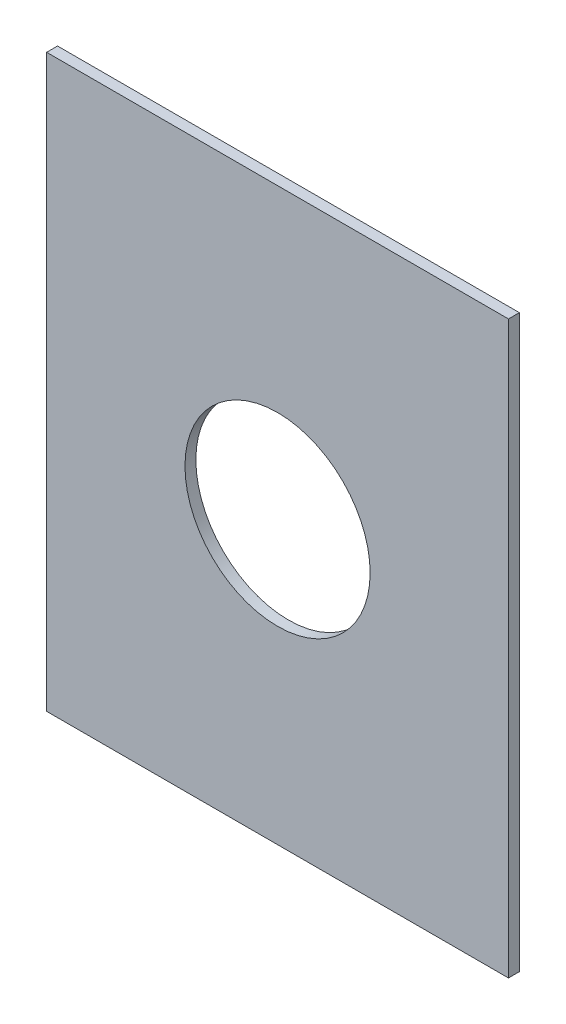
ISO-10303-21;
HEADER;
FILE_DESCRIPTION(('STEP AP214'),'2;1');
FILE_NAME('part.step','',(''),(''),'','','');
FILE_SCHEMA(('AUTOMOTIVE_DESIGN { 1 0 10303 214 1 1 1 1 }'));
ENDSEC;
DATA;
#1=APPLICATION_CONTEXT('core data for automotive mechanical design processes');
#2=APPLICATION_PROTOCOL_DEFINITION('international standard','automotive_design',2000,#1);
#3=PRODUCT_CONTEXT('',#1,'mechanical');
#4=PRODUCT('Part','Part','',(#3));
#5=PRODUCT_RELATED_PRODUCT_CATEGORY('part','',(#4));
#6=PRODUCT_DEFINITION_FORMATION('','',#4);
#7=PRODUCT_DEFINITION_CONTEXT('part definition',#1,'design');
#8=PRODUCT_DEFINITION('design','',#6,#7);
#9=PRODUCT_DEFINITION_SHAPE('','',#8);
#10=(LENGTH_UNIT() NAMED_UNIT(*) SI_UNIT(.MILLI.,.METRE.));
#11=(NAMED_UNIT(*) PLANE_ANGLE_UNIT() SI_UNIT($,.RADIAN.));
#12=(NAMED_UNIT(*) SI_UNIT($,.STERADIAN.) SOLID_ANGLE_UNIT());
#13=UNCERTAINTY_MEASURE_WITH_UNIT(LENGTH_MEASURE(1.E-05),#10,'distance_accuracy_value','');
#14=(GEOMETRIC_REPRESENTATION_CONTEXT(3) GLOBAL_UNCERTAINTY_ASSIGNED_CONTEXT((#13)) GLOBAL_UNIT_ASSIGNED_CONTEXT((#10,
#11,#12)) REPRESENTATION_CONTEXT('',''));
#15=CARTESIAN_POINT('',(0.,0.,0.));
#16=DIRECTION('',(0.,0.,1.));
#17=DIRECTION('',(1.,0.,0.));
#18=AXIS2_PLACEMENT_3D('',#15,#16,#17);
#19=CARTESIAN_POINT('',(0.,0.,5.));
#20=DIRECTION('',(1.,0.,0.));
#21=DIRECTION('',(0.,0.,-1.));
#22=AXIS2_PLACEMENT_3D('',#19,#20,#21);
#23=PLANE('',#22);
#24=DIRECTION('',(0.,-1.,0.));
#25=VECTOR('',#24,1.);
#26=CARTESIAN_POINT('',(0.,0.,0.));
#27=LINE('',#26,#25);
#28=CARTESIAN_POINT('',(0.,262.,0.));
#29=VERTEX_POINT('',#28);
#30=CARTESIAN_POINT('',(0.,0.,0.));
#31=VERTEX_POINT('',#30);
#32=EDGE_CURVE('E96',#29,#31,#27,.T.);
#33=ORIENTED_EDGE('',*,*,#32,.T.);
#34=DIRECTION('',(0.,0.,-1.));
#35=VECTOR('',#34,1.);
#36=CARTESIAN_POINT('',(0.,0.,5.));
#37=LINE('',#36,#35);
#38=CARTESIAN_POINT('',(0.,0.,5.));
#39=VERTEX_POINT('',#38);
#40=EDGE_CURVE('E11',#39,#31,#37,.T.);
#41=ORIENTED_EDGE('',*,*,#40,.F.);
#42=DIRECTION('',(0.,-1.,0.));
#43=VECTOR('',#42,1.);
#44=CARTESIAN_POINT('',(0.,0.,5.));
#45=LINE('',#44,#43);
#46=CARTESIAN_POINT('',(0.,262.,5.));
#47=VERTEX_POINT('',#46);
#48=EDGE_CURVE('E84',#47,#39,#45,.T.);
#49=ORIENTED_EDGE('',*,*,#48,.F.);
#50=DIRECTION('',(0.,0.,-1.));
#51=VECTOR('',#50,1.);
#52=CARTESIAN_POINT('',(0.,262.,5.));
#53=LINE('',#52,#51);
#54=EDGE_CURVE('E92',#47,#29,#53,.T.);
#55=ORIENTED_EDGE('',*,*,#54,.T.);
#56=EDGE_LOOP('',(#33,#41,#49,#55));
#57=FACE_BOUND('',#56,.T.);
#58=ADVANCED_FACE('F33',(#57),#23,.F.);
#59=CARTESIAN_POINT('',(0.,0.,5.));
#60=DIRECTION('',(0.,1.,0.));
#61=DIRECTION('',(0.,0.,1.));
#62=AXIS2_PLACEMENT_3D('',#59,#60,#61);
#63=PLANE('',#62);
#64=DIRECTION('',(1.,0.,0.));
#65=VECTOR('',#64,1.);
#66=CARTESIAN_POINT('',(0.,0.,0.));
#67=LINE('',#66,#65);
#68=CARTESIAN_POINT('',(212.,0.,0.));
#69=VERTEX_POINT('',#68);
#70=EDGE_CURVE('E88',#31,#69,#67,.T.);
#71=ORIENTED_EDGE('',*,*,#70,.T.);
#72=DIRECTION('',(0.,0.,-1.));
#73=VECTOR('',#72,1.);
#74=CARTESIAN_POINT('',(212.,0.,5.));
#75=LINE('',#74,#73);
#76=CARTESIAN_POINT('',(212.,0.,5.));
#77=VERTEX_POINT('',#76);
#78=EDGE_CURVE('E41',#77,#69,#75,.T.);
#79=ORIENTED_EDGE('',*,*,#78,.F.);
#80=DIRECTION('',(1.,0.,0.));
#81=VECTOR('',#80,1.);
#82=CARTESIAN_POINT('',(0.,0.,5.));
#83=LINE('',#82,#81);
#84=EDGE_CURVE('E79',#39,#77,#83,.T.);
#85=ORIENTED_EDGE('',*,*,#84,.F.);
#86=ORIENTED_EDGE('',*,*,#40,.T.);
#87=EDGE_LOOP('',(#71,#79,#85,#86));
#88=FACE_BOUND('',#87,.T.);
#89=ADVANCED_FACE('F87',(#88),#63,.F.);
#90=CARTESIAN_POINT('',(212.,0.,5.));
#91=DIRECTION('',(-1.,0.,0.));
#92=DIRECTION('',(0.,0.,1.));
#93=AXIS2_PLACEMENT_3D('',#90,#91,#92);
#94=PLANE('',#93);
#95=DIRECTION('',(0.,1.,0.));
#96=VECTOR('',#95,1.);
#97=CARTESIAN_POINT('',(212.,0.,0.));
#98=LINE('',#97,#96);
#99=CARTESIAN_POINT('',(212.,262.,0.));
#100=VERTEX_POINT('',#99);
#101=EDGE_CURVE('E66',#69,#100,#98,.T.);
#102=ORIENTED_EDGE('',*,*,#101,.T.);
#103=DIRECTION('',(0.,0.,-1.));
#104=VECTOR('',#103,1.);
#105=CARTESIAN_POINT('',(212.,262.,5.));
#106=LINE('',#105,#104);
#107=CARTESIAN_POINT('',(212.,262.,5.));
#108=VERTEX_POINT('',#107);
#109=EDGE_CURVE('E89',#108,#100,#106,.T.);
#110=ORIENTED_EDGE('',*,*,#109,.F.);
#111=DIRECTION('',(0.,1.,0.));
#112=VECTOR('',#111,1.);
#113=CARTESIAN_POINT('',(212.,0.,5.));
#114=LINE('',#113,#112);
#115=EDGE_CURVE('E82',#77,#108,#114,.T.);
#116=ORIENTED_EDGE('',*,*,#115,.F.);
#117=ORIENTED_EDGE('',*,*,#78,.T.);
#118=EDGE_LOOP('',(#102,#110,#116,#117));
#119=FACE_BOUND('',#118,.T.);
#120=ADVANCED_FACE('F90',(#119),#94,.F.);
#121=CARTESIAN_POINT('',(0.,262.,5.));
#122=DIRECTION('',(0.,-1.,0.));
#123=DIRECTION('',(0.,0.,-1.));
#124=AXIS2_PLACEMENT_3D('',#121,#122,#123);
#125=PLANE('',#124);
#126=DIRECTION('',(-1.,0.,0.));
#127=VECTOR('',#126,1.);
#128=CARTESIAN_POINT('',(0.,262.,0.));
#129=LINE('',#128,#127);
#130=EDGE_CURVE('E72',#100,#29,#129,.T.);
#131=ORIENTED_EDGE('',*,*,#130,.T.);
#132=ORIENTED_EDGE('',*,*,#54,.F.);
#133=DIRECTION('',(-1.,0.,0.));
#134=VECTOR('',#133,1.);
#135=CARTESIAN_POINT('',(0.,262.,5.));
#136=LINE('',#135,#134);
#137=EDGE_CURVE('E49',#108,#47,#136,.T.);
#138=ORIENTED_EDGE('',*,*,#137,.F.);
#139=ORIENTED_EDGE('',*,*,#109,.T.);
#140=EDGE_LOOP('',(#131,#132,#138,#139));
#141=FACE_BOUND('',#140,.T.);
#142=ADVANCED_FACE('F104',(#141),#125,.F.);
#143=CARTESIAN_POINT('',(0.,0.,5.));
#144=DIRECTION('',(0.,0.,-1.));
#145=DIRECTION('',(-1.,0.,0.));
#146=AXIS2_PLACEMENT_3D('',#143,#144,#145);
#147=PLANE('',#146);
#148=CARTESIAN_POINT('',(106.,129.3,5.));
#149=DIRECTION('',(0.,0.,-1.));
#150=DIRECTION('',(-1.,0.,0.));
#151=AXIS2_PLACEMENT_3D('',#148,#149,#150);
#152=CIRCLE('',#151,42.5);
#153=CARTESIAN_POINT('',(63.5,129.3,5.));
#154=VERTEX_POINT('',#153);
#155=EDGE_CURVE('E99',#154,#154,#152,.T.);
#156=ORIENTED_EDGE('',*,*,#155,.T.);
#157=EDGE_LOOP('',(#156));
#158=FACE_BOUND('',#157,.T.);
#159=ORIENTED_EDGE('',*,*,#48,.T.);
#160=ORIENTED_EDGE('',*,*,#84,.T.);
#161=ORIENTED_EDGE('',*,*,#115,.T.);
#162=ORIENTED_EDGE('',*,*,#137,.T.);
#163=EDGE_LOOP('',(#159,#160,#161,#162));
#164=FACE_BOUND('',#163,.T.);
#165=ADVANCED_FACE('F80',(#158,#164),#147,.F.);
#166=CARTESIAN_POINT('',(0.,0.,0.));
#167=DIRECTION('',(0.,0.,-1.));
#168=DIRECTION('',(-1.,0.,0.));
#169=AXIS2_PLACEMENT_3D('',#166,#167,#168);
#170=PLANE('',#169);
#171=CARTESIAN_POINT('',(106.,129.3,0.));
#172=DIRECTION('',(0.,0.,-1.));
#173=DIRECTION('',(-1.,0.,0.));
#174=AXIS2_PLACEMENT_3D('',#171,#172,#173);
#175=CIRCLE('',#174,42.5);
#176=CARTESIAN_POINT('',(63.5,129.3,0.));
#177=VERTEX_POINT('',#176);
#178=EDGE_CURVE('E110',#177,#177,#175,.T.);
#179=ORIENTED_EDGE('',*,*,#178,.F.);
#180=EDGE_LOOP('',(#179));
#181=FACE_BOUND('',#180,.T.);
#182=ORIENTED_EDGE('',*,*,#32,.F.);
#183=ORIENTED_EDGE('',*,*,#130,.F.);
#184=ORIENTED_EDGE('',*,*,#101,.F.);
#185=ORIENTED_EDGE('',*,*,#70,.F.);
#186=EDGE_LOOP('',(#182,#183,#184,#185));
#187=FACE_BOUND('',#186,.T.);
#188=ADVANCED_FACE('F107',(#181,#187),#170,.T.);
#189=CARTESIAN_POINT('',(106.,129.3,5.));
#190=DIRECTION('',(0.,0.,-1.));
#191=DIRECTION('',(-1.,0.,0.));
#192=AXIS2_PLACEMENT_3D('',#189,#190,#191);
#193=CYLINDRICAL_SURFACE('',#192,42.5);
#194=ORIENTED_EDGE('',*,*,#155,.F.);
#195=EDGE_LOOP('',(#194));
#196=FACE_BOUND('',#195,.T.);
#197=ORIENTED_EDGE('',*,*,#178,.T.);
#198=EDGE_LOOP('',(#197));
#199=FACE_BOUND('',#198,.T.);
#200=ADVANCED_FACE('F117',(#196,#199),#193,.F.);
#201=CLOSED_SHELL('',(#58,#89,#120,#142,#165,#188,#200));
#202=MANIFOLD_SOLID_BREP('B2',#201);
#203=ADVANCED_BREP_SHAPE_REPRESENTATION('',(#18,#202),#14);
#204=SHAPE_DEFINITION_REPRESENTATION(#9,#203);
ENDSEC;
END-ISO-10303-21;
